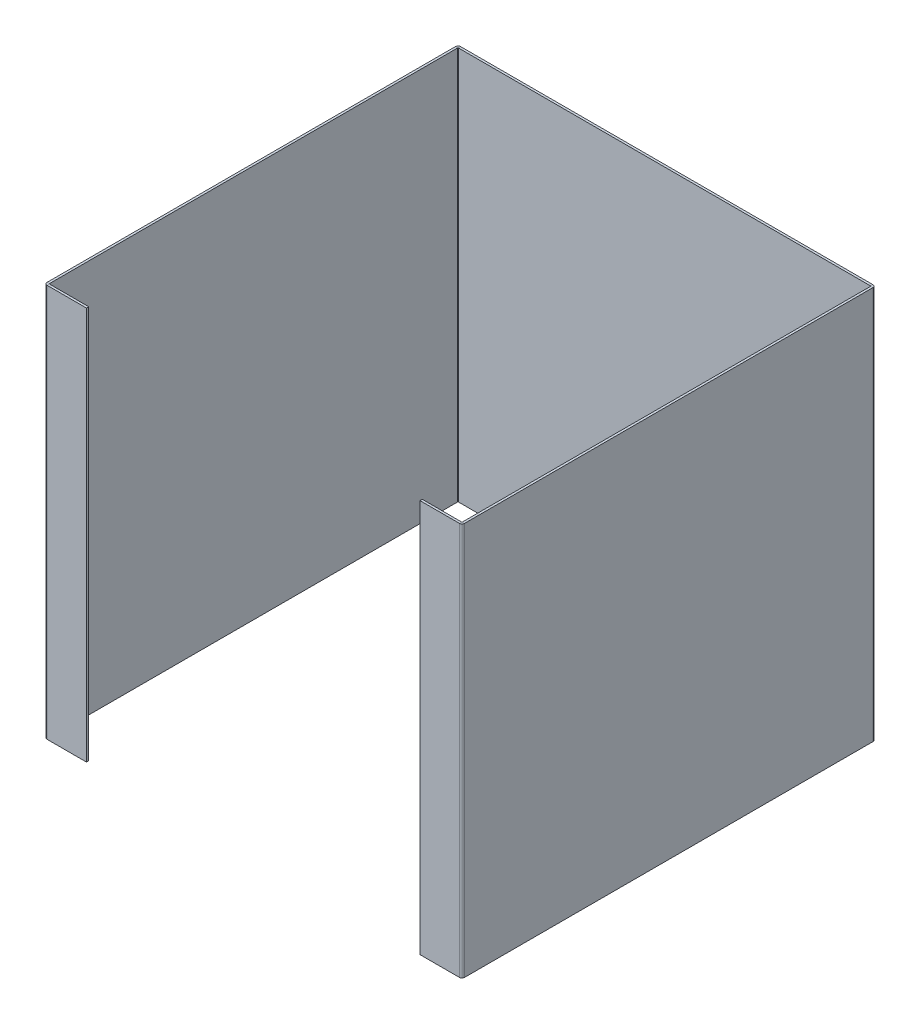
ISO-10303-21;
HEADER;
FILE_DESCRIPTION(('STEP AP214'),'2;1');
FILE_NAME('part.step','',(''),(''),'','','');
FILE_SCHEMA(('AUTOMOTIVE_DESIGN { 1 0 10303 214 1 1 1 1 }'));
ENDSEC;
DATA;
#1=APPLICATION_CONTEXT('core data for automotive mechanical design processes');
#2=APPLICATION_PROTOCOL_DEFINITION('international standard','automotive_design',2000,#1);
#3=PRODUCT_CONTEXT('',#1,'mechanical');
#4=PRODUCT('Part','Part','',(#3));
#5=PRODUCT_RELATED_PRODUCT_CATEGORY('part','',(#4));
#6=PRODUCT_DEFINITION_FORMATION('','',#4);
#7=PRODUCT_DEFINITION_CONTEXT('part definition',#1,'design');
#8=PRODUCT_DEFINITION('design','',#6,#7);
#9=PRODUCT_DEFINITION_SHAPE('','',#8);
#10=(LENGTH_UNIT() NAMED_UNIT(*) SI_UNIT(.MILLI.,.METRE.));
#11=(NAMED_UNIT(*) PLANE_ANGLE_UNIT() SI_UNIT($,.RADIAN.));
#12=(NAMED_UNIT(*) SI_UNIT($,.STERADIAN.) SOLID_ANGLE_UNIT());
#13=UNCERTAINTY_MEASURE_WITH_UNIT(LENGTH_MEASURE(1.E-05),#10,'distance_accuracy_value','');
#14=(GEOMETRIC_REPRESENTATION_CONTEXT(3) GLOBAL_UNCERTAINTY_ASSIGNED_CONTEXT((#13)) GLOBAL_UNIT_ASSIGNED_CONTEXT((#10,
#11,#12)) REPRESENTATION_CONTEXT('',''));
#15=CARTESIAN_POINT('',(0.,0.,0.));
#16=DIRECTION('',(0.,0.,1.));
#17=DIRECTION('',(1.,0.,0.));
#18=AXIS2_PLACEMENT_3D('',#15,#16,#17);
#19=CARTESIAN_POINT('',(-199.05892,0.,0.));
#20=DIRECTION('',(0.,-1.,0.));
#21=DIRECTION('',(0.,0.,1.));
#22=AXIS2_PLACEMENT_3D('',#19,#20,#21);
#23=PLANE('',#22);
#24=DIRECTION('',(-1.,0.,0.));
#25=VECTOR('',#24,1.);
#26=CARTESIAN_POINT('',(-199.05892,0.,194.619));
#27=LINE('',#26,#25);
#28=CARTESIAN_POINT('',(-196.89992,0.,194.619));
#29=VERTEX_POINT('',#28);
#30=CARTESIAN_POINT('',(-199.05892,0.,194.619));
#31=VERTEX_POINT('',#30);
#32=EDGE_CURVE('E12',#29,#31,#27,.T.);
#33=ORIENTED_EDGE('',*,*,#32,.F.);
#34=DIRECTION('',(0.,0.,1.));
#35=VECTOR('',#34,1.);
#36=CARTESIAN_POINT('',(-196.89992,0.,0.));
#37=LINE('',#36,#35);
#38=CARTESIAN_POINT('',(-196.89992,0.,-194.619));
#39=VERTEX_POINT('',#38);
#40=EDGE_CURVE('E157',#39,#29,#37,.T.);
#41=ORIENTED_EDGE('',*,*,#40,.F.);
#42=DIRECTION('',(-1.,0.,0.));
#43=VECTOR('',#42,1.);
#44=CARTESIAN_POINT('',(-199.05892,0.,-194.619));
#45=LINE('',#44,#43);
#46=CARTESIAN_POINT('',(-199.05892,0.,-194.619));
#47=VERTEX_POINT('',#46);
#48=EDGE_CURVE('E79',#39,#47,#45,.T.);
#49=ORIENTED_EDGE('',*,*,#48,.T.);
#50=DIRECTION('',(0.,0.,1.));
#51=VECTOR('',#50,1.);
#52=CARTESIAN_POINT('',(-199.05892,0.,0.));
#53=LINE('',#52,#51);
#54=EDGE_CURVE('E160',#47,#31,#53,.T.);
#55=ORIENTED_EDGE('',*,*,#54,.T.);
#56=EDGE_LOOP('',(#33,#41,#49,#55));
#57=FACE_BOUND('',#56,.T.);
#58=ADVANCED_FACE('F69',(#57),#23,.F.);
#59=CARTESIAN_POINT('',(-196.51892,0.,-194.619));
#60=DIRECTION('',(0.,-1.,0.));
#61=DIRECTION('',(0.,0.,-1.));
#62=AXIS2_PLACEMENT_3D('',#59,#60,#61);
#63=PLANE('',#62);
#64=ORIENTED_EDGE('',*,*,#48,.F.);
#65=CARTESIAN_POINT('',(-196.51892,0.,-194.619));
#66=DIRECTION('',(0.,1.,0.));
#67=DIRECTION('',(0.,0.,1.));
#68=AXIS2_PLACEMENT_3D('',#65,#66,#67);
#69=CIRCLE('',#68,0.381);
#70=CARTESIAN_POINT('',(-196.51892,0.,-195.));
#71=VERTEX_POINT('',#70);
#72=EDGE_CURVE('E199',#39,#71,#69,.F.);
#73=ORIENTED_EDGE('',*,*,#72,.T.);
#74=DIRECTION('',(0.,0.,-1.));
#75=VECTOR('',#74,1.);
#76=CARTESIAN_POINT('',(-196.51892,0.,-197.159));
#77=LINE('',#76,#75);
#78=CARTESIAN_POINT('',(-196.51892,0.,-197.159));
#79=VERTEX_POINT('',#78);
#80=EDGE_CURVE('E250',#71,#79,#77,.T.);
#81=ORIENTED_EDGE('',*,*,#80,.T.);
#82=CARTESIAN_POINT('',(-196.51892,0.,-194.619));
#83=DIRECTION('',(0.,1.,0.));
#84=DIRECTION('',(0.,0.,1.));
#85=AXIS2_PLACEMENT_3D('',#82,#83,#84);
#86=CIRCLE('',#85,2.54);
#87=EDGE_CURVE('E272',#47,#79,#86,.F.);
#88=ORIENTED_EDGE('',*,*,#87,.F.);
#89=EDGE_LOOP('',(#64,#73,#81,#88));
#90=FACE_BOUND('',#89,.T.);
#91=ADVANCED_FACE('F273',(#90),#63,.F.);
#92=CARTESIAN_POINT('',(0.,0.,-197.159));
#93=DIRECTION('',(0.,-1.,0.));
#94=DIRECTION('',(-1.,0.,0.));
#95=AXIS2_PLACEMENT_3D('',#92,#93,#94);
#96=PLANE('',#95);
#97=ORIENTED_EDGE('',*,*,#80,.F.);
#98=DIRECTION('',(-1.,0.,0.));
#99=VECTOR('',#98,1.);
#100=CARTESIAN_POINT('',(0.,0.,-195.));
#101=LINE('',#100,#99);
#102=CARTESIAN_POINT('',(196.51892,0.,-195.));
#103=VERTEX_POINT('',#102);
#104=EDGE_CURVE('E353',#103,#71,#101,.T.);
#105=ORIENTED_EDGE('',*,*,#104,.F.);
#106=DIRECTION('',(0.,0.,-1.));
#107=VECTOR('',#106,1.);
#108=CARTESIAN_POINT('',(196.51892,0.,-197.159));
#109=LINE('',#108,#107);
#110=CARTESIAN_POINT('',(196.51892,0.,-197.159));
#111=VERTEX_POINT('',#110);
#112=EDGE_CURVE('E247',#103,#111,#109,.T.);
#113=ORIENTED_EDGE('',*,*,#112,.T.);
#114=DIRECTION('',(-1.,0.,0.));
#115=VECTOR('',#114,1.);
#116=CARTESIAN_POINT('',(0.,0.,-197.159));
#117=LINE('',#116,#115);
#118=EDGE_CURVE('E395',#111,#79,#117,.T.);
#119=ORIENTED_EDGE('',*,*,#118,.T.);
#120=EDGE_LOOP('',(#97,#105,#113,#119));
#121=FACE_BOUND('',#120,.T.);
#122=ADVANCED_FACE('F392',(#121),#96,.F.);
#123=CARTESIAN_POINT('',(196.51892,0.,-194.619));
#124=DIRECTION('',(0.,-1.,0.));
#125=DIRECTION('',(0.,0.,-1.));
#126=AXIS2_PLACEMENT_3D('',#123,#124,#125);
#127=PLANE('',#126);
#128=ORIENTED_EDGE('',*,*,#112,.F.);
#129=CARTESIAN_POINT('',(196.51892,0.,-194.619));
#130=DIRECTION('',(0.,1.,0.));
#131=DIRECTION('',(0.,0.,1.));
#132=AXIS2_PLACEMENT_3D('',#129,#130,#131);
#133=CIRCLE('',#132,0.381);
#134=CARTESIAN_POINT('',(196.89992,0.,-194.619));
#135=VERTEX_POINT('',#134);
#136=EDGE_CURVE('E358',#103,#135,#133,.F.);
#137=ORIENTED_EDGE('',*,*,#136,.T.);
#138=DIRECTION('',(1.,0.,0.));
#139=VECTOR('',#138,1.);
#140=CARTESIAN_POINT('',(199.05892,0.,-194.619));
#141=LINE('',#140,#139);
#142=CARTESIAN_POINT('',(199.05892,0.,-194.619));
#143=VERTEX_POINT('',#142);
#144=EDGE_CURVE('E244',#135,#143,#141,.T.);
#145=ORIENTED_EDGE('',*,*,#144,.T.);
#146=CARTESIAN_POINT('',(196.51892,0.,-194.619));
#147=DIRECTION('',(0.,1.,0.));
#148=DIRECTION('',(0.,0.,1.));
#149=AXIS2_PLACEMENT_3D('',#146,#147,#148);
#150=CIRCLE('',#149,2.54);
#151=EDGE_CURVE('E303',#111,#143,#150,.F.);
#152=ORIENTED_EDGE('',*,*,#151,.F.);
#153=EDGE_LOOP('',(#128,#137,#145,#152));
#154=FACE_BOUND('',#153,.T.);
#155=ADVANCED_FACE('F518',(#154),#127,.F.);
#156=CARTESIAN_POINT('',(199.05892,0.,0.));
#157=DIRECTION('',(0.,-1.,0.));
#158=DIRECTION('',(0.,0.,-1.));
#159=AXIS2_PLACEMENT_3D('',#156,#157,#158);
#160=PLANE('',#159);
#161=ORIENTED_EDGE('',*,*,#144,.F.);
#162=DIRECTION('',(0.,0.,-1.));
#163=VECTOR('',#162,1.);
#164=CARTESIAN_POINT('',(196.89992,0.,0.));
#165=LINE('',#164,#163);
#166=CARTESIAN_POINT('',(196.89992,0.,194.619));
#167=VERTEX_POINT('',#166);
#168=EDGE_CURVE('E196',#167,#135,#165,.T.);
#169=ORIENTED_EDGE('',*,*,#168,.F.);
#170=DIRECTION('',(1.,0.,0.));
#171=VECTOR('',#170,1.);
#172=CARTESIAN_POINT('',(199.05892,0.,194.619));
#173=LINE('',#172,#171);
#174=CARTESIAN_POINT('',(199.05892,0.,194.619));
#175=VERTEX_POINT('',#174);
#176=EDGE_CURVE('E87',#167,#175,#173,.T.);
#177=ORIENTED_EDGE('',*,*,#176,.T.);
#178=DIRECTION('',(0.,0.,-1.));
#179=VECTOR('',#178,1.);
#180=CARTESIAN_POINT('',(199.05892,0.,0.));
#181=LINE('',#180,#179);
#182=EDGE_CURVE('E459',#175,#143,#181,.T.);
#183=ORIENTED_EDGE('',*,*,#182,.T.);
#184=EDGE_LOOP('',(#161,#169,#177,#183));
#185=FACE_BOUND('',#184,.T.);
#186=ADVANCED_FACE('F519',(#185),#160,.F.);
#187=CARTESIAN_POINT('',(196.51892,0.,194.619));
#188=DIRECTION('',(0.,-1.,0.));
#189=DIRECTION('',(0.,0.,-1.));
#190=AXIS2_PLACEMENT_3D('',#187,#188,#189);
#191=PLANE('',#190);
#192=ORIENTED_EDGE('',*,*,#176,.F.);
#193=CARTESIAN_POINT('',(196.51892,0.,194.619));
#194=DIRECTION('',(0.,1.,0.));
#195=DIRECTION('',(0.,0.,1.));
#196=AXIS2_PLACEMENT_3D('',#193,#194,#195);
#197=CIRCLE('',#196,0.381);
#198=CARTESIAN_POINT('',(196.51892,0.,195.));
#199=VERTEX_POINT('',#198);
#200=EDGE_CURVE('E366',#167,#199,#197,.F.);
#201=ORIENTED_EDGE('',*,*,#200,.T.);
#202=DIRECTION('',(0.,0.,1.));
#203=VECTOR('',#202,1.);
#204=CARTESIAN_POINT('',(196.51892,0.,197.159));
#205=LINE('',#204,#203);
#206=CARTESIAN_POINT('',(196.51892,0.,197.159));
#207=VERTEX_POINT('',#206);
#208=EDGE_CURVE('E240',#199,#207,#205,.T.);
#209=ORIENTED_EDGE('',*,*,#208,.T.);
#210=CARTESIAN_POINT('',(196.51892,0.,194.619));
#211=DIRECTION('',(0.,1.,0.));
#212=DIRECTION('',(0.,0.,1.));
#213=AXIS2_PLACEMENT_3D('',#210,#211,#212);
#214=CIRCLE('',#213,2.54);
#215=EDGE_CURVE('E315',#175,#207,#214,.F.);
#216=ORIENTED_EDGE('',*,*,#215,.F.);
#217=EDGE_LOOP('',(#192,#201,#209,#216));
#218=FACE_BOUND('',#217,.T.);
#219=ADVANCED_FACE('F423',(#218),#191,.F.);
#220=CARTESIAN_POINT('',(0.,0.,197.159));
#221=DIRECTION('',(0.,-1.,0.));
#222=DIRECTION('',(1.,0.,0.));
#223=AXIS2_PLACEMENT_3D('',#220,#221,#222);
#224=PLANE('',#223);
#225=ORIENTED_EDGE('',*,*,#208,.F.);
#226=DIRECTION('',(1.,0.,0.));
#227=VECTOR('',#226,1.);
#228=CARTESIAN_POINT('',(0.,0.,195.));
#229=LINE('',#228,#227);
#230=CARTESIAN_POINT('',(159.05892,0.,195.));
#231=VERTEX_POINT('',#230);
#232=EDGE_CURVE('E189',#231,#199,#229,.T.);
#233=ORIENTED_EDGE('',*,*,#232,.F.);
#234=DIRECTION('',(0.,0.,1.));
#235=VECTOR('',#234,1.);
#236=CARTESIAN_POINT('',(159.05892,0.,197.159));
#237=LINE('',#236,#235);
#238=CARTESIAN_POINT('',(159.05892,0.,197.159));
#239=VERTEX_POINT('',#238);
#240=EDGE_CURVE('E237',#231,#239,#237,.T.);
#241=ORIENTED_EDGE('',*,*,#240,.T.);
#242=DIRECTION('',(1.,0.,0.));
#243=VECTOR('',#242,1.);
#244=CARTESIAN_POINT('',(0.,0.,197.159));
#245=LINE('',#244,#243);
#246=EDGE_CURVE('E269',#239,#207,#245,.T.);
#247=ORIENTED_EDGE('',*,*,#246,.T.);
#248=EDGE_LOOP('',(#225,#233,#241,#247));
#249=FACE_BOUND('',#248,.T.);
#250=ADVANCED_FACE('F433',(#249),#224,.F.);
#251=CARTESIAN_POINT('',(159.05892,0.,197.159));
#252=DIRECTION('',(1.,0.,0.));
#253=DIRECTION('',(0.,1.,0.));
#254=AXIS2_PLACEMENT_3D('',#251,#252,#253);
#255=PLANE('',#254);
#256=ORIENTED_EDGE('',*,*,#240,.F.);
#257=DIRECTION('',(0.,1.,0.));
#258=VECTOR('',#257,1.);
#259=CARTESIAN_POINT('',(159.05892,-375.,195.));
#260=LINE('',#259,#258);
#261=CARTESIAN_POINT('',(159.05892,-375.,195.));
#262=VERTEX_POINT('',#261);
#263=EDGE_CURVE('E352',#262,#231,#260,.T.);
#264=ORIENTED_EDGE('',*,*,#263,.F.);
#265=DIRECTION('',(0.,0.,1.));
#266=VECTOR('',#265,1.);
#267=CARTESIAN_POINT('',(159.05892,-375.,197.159));
#268=LINE('',#267,#266);
#269=CARTESIAN_POINT('',(159.05892,-375.,197.159));
#270=VERTEX_POINT('',#269);
#271=EDGE_CURVE('E234',#262,#270,#268,.T.);
#272=ORIENTED_EDGE('',*,*,#271,.T.);
#273=DIRECTION('',(0.,1.,0.));
#274=VECTOR('',#273,1.);
#275=CARTESIAN_POINT('',(159.05892,0.,197.159));
#276=LINE('',#275,#274);
#277=EDGE_CURVE('E445',#270,#239,#276,.T.);
#278=ORIENTED_EDGE('',*,*,#277,.T.);
#279=EDGE_LOOP('',(#256,#264,#272,#278));
#280=FACE_BOUND('',#279,.T.);
#281=ADVANCED_FACE('F496',(#280),#255,.F.);
#282=CARTESIAN_POINT('',(0.,-375.,197.159));
#283=DIRECTION('',(0.,-1.,0.));
#284=DIRECTION('',(1.,0.,0.));
#285=AXIS2_PLACEMENT_3D('',#282,#283,#284);
#286=PLANE('',#285);
#287=ORIENTED_EDGE('',*,*,#271,.F.);
#288=DIRECTION('',(1.,0.,0.));
#289=VECTOR('',#288,1.);
#290=CARTESIAN_POINT('',(0.,-375.,195.));
#291=LINE('',#290,#289);
#292=CARTESIAN_POINT('',(196.51892,-375.,195.));
#293=VERTEX_POINT('',#292);
#294=EDGE_CURVE('E367',#262,#293,#291,.T.);
#295=ORIENTED_EDGE('',*,*,#294,.T.);
#296=DIRECTION('',(0.,0.,1.));
#297=VECTOR('',#296,1.);
#298=CARTESIAN_POINT('',(196.51892,-375.,197.159));
#299=LINE('',#298,#297);
#300=CARTESIAN_POINT('',(196.51892,-375.,197.159));
#301=VERTEX_POINT('',#300);
#302=EDGE_CURVE('E231',#293,#301,#299,.T.);
#303=ORIENTED_EDGE('',*,*,#302,.T.);
#304=DIRECTION('',(1.,0.,0.));
#305=VECTOR('',#304,1.);
#306=CARTESIAN_POINT('',(0.,-375.,197.159));
#307=LINE('',#306,#305);
#308=EDGE_CURVE('E438',#270,#301,#307,.T.);
#309=ORIENTED_EDGE('',*,*,#308,.F.);
#310=EDGE_LOOP('',(#287,#295,#303,#309));
#311=FACE_BOUND('',#310,.T.);
#312=ADVANCED_FACE('F498',(#311),#286,.T.);
#313=CARTESIAN_POINT('',(196.51892,-375.,194.619));
#314=DIRECTION('',(0.,1.,0.));
#315=DIRECTION('',(0.,0.,1.));
#316=AXIS2_PLACEMENT_3D('',#313,#314,#315);
#317=PLANE('',#316);
#318=ORIENTED_EDGE('',*,*,#302,.F.);
#319=CARTESIAN_POINT('',(196.51892,-375.,194.619));
#320=DIRECTION('',(0.,1.,0.));
#321=DIRECTION('',(0.,0.,1.));
#322=AXIS2_PLACEMENT_3D('',#319,#320,#321);
#323=CIRCLE('',#322,0.381);
#324=CARTESIAN_POINT('',(196.89992,-375.,194.619));
#325=VERTEX_POINT('',#324);
#326=EDGE_CURVE('E363',#293,#325,#323,.T.);
#327=ORIENTED_EDGE('',*,*,#326,.T.);
#328=DIRECTION('',(1.,0.,0.));
#329=VECTOR('',#328,1.);
#330=CARTESIAN_POINT('',(199.05892,-375.,194.619));
#331=LINE('',#330,#329);
#332=CARTESIAN_POINT('',(199.05892,-375.,194.619));
#333=VERTEX_POINT('',#332);
#334=EDGE_CURVE('E229',#325,#333,#331,.T.);
#335=ORIENTED_EDGE('',*,*,#334,.T.);
#336=CARTESIAN_POINT('',(196.51892,-375.,194.619));
#337=DIRECTION('',(0.,-1.,0.));
#338=DIRECTION('',(0.,0.,-1.));
#339=AXIS2_PLACEMENT_3D('',#336,#337,#338);
#340=CIRCLE('',#339,2.54);
#341=EDGE_CURVE('E306',#301,#333,#340,.F.);
#342=ORIENTED_EDGE('',*,*,#341,.F.);
#343=EDGE_LOOP('',(#318,#327,#335,#342));
#344=FACE_BOUND('',#343,.T.);
#345=ADVANCED_FACE('F450',(#344),#317,.F.);
#346=CARTESIAN_POINT('',(199.05892,-375.,0.));
#347=DIRECTION('',(0.,-1.,0.));
#348=DIRECTION('',(0.,0.,-1.));
#349=AXIS2_PLACEMENT_3D('',#346,#347,#348);
#350=PLANE('',#349);
#351=ORIENTED_EDGE('',*,*,#334,.F.);
#352=DIRECTION('',(0.,0.,-1.));
#353=VECTOR('',#352,1.);
#354=CARTESIAN_POINT('',(196.89992,-375.,0.));
#355=LINE('',#354,#353);
#356=CARTESIAN_POINT('',(196.89992,-375.,-194.619));
#357=VERTEX_POINT('',#356);
#358=EDGE_CURVE('E359',#325,#357,#355,.T.);
#359=ORIENTED_EDGE('',*,*,#358,.T.);
#360=DIRECTION('',(1.,0.,0.));
#361=VECTOR('',#360,1.);
#362=CARTESIAN_POINT('',(199.05892,-375.,-194.619));
#363=LINE('',#362,#361);
#364=CARTESIAN_POINT('',(199.05892,-375.,-194.619));
#365=VERTEX_POINT('',#364);
#366=EDGE_CURVE('E225',#357,#365,#363,.T.);
#367=ORIENTED_EDGE('',*,*,#366,.T.);
#368=DIRECTION('',(0.,0.,-1.));
#369=VECTOR('',#368,1.);
#370=CARTESIAN_POINT('',(199.05892,-375.,0.));
#371=LINE('',#370,#369);
#372=EDGE_CURVE('E402',#333,#365,#371,.T.);
#373=ORIENTED_EDGE('',*,*,#372,.F.);
#374=EDGE_LOOP('',(#351,#359,#367,#373));
#375=FACE_BOUND('',#374,.T.);
#376=ADVANCED_FACE('F455',(#375),#350,.T.);
#377=CARTESIAN_POINT('',(196.51892,-375.,-194.619));
#378=DIRECTION('',(0.,1.,0.));
#379=DIRECTION('',(0.,0.,1.));
#380=AXIS2_PLACEMENT_3D('',#377,#378,#379);
#381=PLANE('',#380);
#382=ORIENTED_EDGE('',*,*,#366,.F.);
#383=CARTESIAN_POINT('',(196.51892,-375.,-194.619));
#384=DIRECTION('',(0.,1.,0.));
#385=DIRECTION('',(0.,0.,1.));
#386=AXIS2_PLACEMENT_3D('',#383,#384,#385);
#387=CIRCLE('',#386,0.381);
#388=CARTESIAN_POINT('',(196.51892,-375.,-195.));
#389=VERTEX_POINT('',#388);
#390=EDGE_CURVE('E354',#357,#389,#387,.T.);
#391=ORIENTED_EDGE('',*,*,#390,.T.);
#392=DIRECTION('',(0.,0.,-1.));
#393=VECTOR('',#392,1.);
#394=CARTESIAN_POINT('',(196.51892,-375.,-197.159));
#395=LINE('',#394,#393);
#396=CARTESIAN_POINT('',(196.51892,-375.,-197.159));
#397=VERTEX_POINT('',#396);
#398=EDGE_CURVE('E221',#389,#397,#395,.T.);
#399=ORIENTED_EDGE('',*,*,#398,.T.);
#400=CARTESIAN_POINT('',(196.51892,-375.,-194.619));
#401=DIRECTION('',(0.,-1.,0.));
#402=DIRECTION('',(0.,0.,-1.));
#403=AXIS2_PLACEMENT_3D('',#400,#401,#402);
#404=CIRCLE('',#403,2.54);
#405=EDGE_CURVE('E279',#365,#397,#404,.F.);
#406=ORIENTED_EDGE('',*,*,#405,.F.);
#407=EDGE_LOOP('',(#382,#391,#399,#406));
#408=FACE_BOUND('',#407,.T.);
#409=ADVANCED_FACE('F513',(#408),#381,.F.);
#410=CARTESIAN_POINT('',(0.,-375.,-197.159));
#411=DIRECTION('',(0.,-1.,0.));
#412=DIRECTION('',(-1.,0.,0.));
#413=AXIS2_PLACEMENT_3D('',#410,#411,#412);
#414=PLANE('',#413);
#415=ORIENTED_EDGE('',*,*,#398,.F.);
#416=DIRECTION('',(-1.,0.,0.));
#417=VECTOR('',#416,1.);
#418=CARTESIAN_POINT('',(0.,-375.,-195.));
#419=LINE('',#418,#417);
#420=CARTESIAN_POINT('',(-196.51892,-375.,-195.));
#421=VERTEX_POINT('',#420);
#422=EDGE_CURVE('E348',#389,#421,#419,.T.);
#423=ORIENTED_EDGE('',*,*,#422,.T.);
#424=DIRECTION('',(0.,0.,-1.));
#425=VECTOR('',#424,1.);
#426=CARTESIAN_POINT('',(-196.51892,-375.,-197.159));
#427=LINE('',#426,#425);
#428=CARTESIAN_POINT('',(-196.51892,-375.,-197.159));
#429=VERTEX_POINT('',#428);
#430=EDGE_CURVE('E218',#421,#429,#427,.T.);
#431=ORIENTED_EDGE('',*,*,#430,.T.);
#432=DIRECTION('',(-1.,0.,0.));
#433=VECTOR('',#432,1.);
#434=CARTESIAN_POINT('',(0.,-375.,-197.159));
#435=LINE('',#434,#433);
#436=EDGE_CURVE('E401',#397,#429,#435,.T.);
#437=ORIENTED_EDGE('',*,*,#436,.F.);
#438=EDGE_LOOP('',(#415,#423,#431,#437));
#439=FACE_BOUND('',#438,.T.);
#440=ADVANCED_FACE('F612',(#439),#414,.T.);
#441=CARTESIAN_POINT('',(-196.51892,-375.,-194.619));
#442=DIRECTION('',(0.,1.,0.));
#443=DIRECTION('',(0.,0.,1.));
#444=AXIS2_PLACEMENT_3D('',#441,#442,#443);
#445=PLANE('',#444);
#446=ORIENTED_EDGE('',*,*,#430,.F.);
#447=CARTESIAN_POINT('',(-196.51892,-375.,-194.619));
#448=DIRECTION('',(0.,1.,0.));
#449=DIRECTION('',(0.,0.,1.));
#450=AXIS2_PLACEMENT_3D('',#447,#448,#449);
#451=CIRCLE('',#450,0.381);
#452=CARTESIAN_POINT('',(-196.89992,-375.,-194.619));
#453=VERTEX_POINT('',#452);
#454=EDGE_CURVE('E194',#421,#453,#451,.T.);
#455=ORIENTED_EDGE('',*,*,#454,.T.);
#456=DIRECTION('',(-1.,0.,0.));
#457=VECTOR('',#456,1.);
#458=CARTESIAN_POINT('',(-199.05892,-375.,-194.619));
#459=LINE('',#458,#457);
#460=CARTESIAN_POINT('',(-199.05892,-375.,-194.619));
#461=VERTEX_POINT('',#460);
#462=EDGE_CURVE('E215',#453,#461,#459,.T.);
#463=ORIENTED_EDGE('',*,*,#462,.T.);
#464=CARTESIAN_POINT('',(-196.51892,-375.,-194.619));
#465=DIRECTION('',(0.,-1.,0.));
#466=DIRECTION('',(0.,0.,-1.));
#467=AXIS2_PLACEMENT_3D('',#464,#465,#466);
#468=CIRCLE('',#467,2.54);
#469=EDGE_CURVE('E278',#429,#461,#468,.F.);
#470=ORIENTED_EDGE('',*,*,#469,.F.);
#471=EDGE_LOOP('',(#446,#455,#463,#470));
#472=FACE_BOUND('',#471,.T.);
#473=ADVANCED_FACE('F622',(#472),#445,.F.);
#474=CARTESIAN_POINT('',(-199.05892,-375.,0.));
#475=DIRECTION('',(0.,-1.,0.));
#476=DIRECTION('',(0.,0.,1.));
#477=AXIS2_PLACEMENT_3D('',#474,#475,#476);
#478=PLANE('',#477);
#479=ORIENTED_EDGE('',*,*,#462,.F.);
#480=DIRECTION('',(0.,0.,1.));
#481=VECTOR('',#480,1.);
#482=CARTESIAN_POINT('',(-196.89992,-375.,0.));
#483=LINE('',#482,#481);
#484=CARTESIAN_POINT('',(-196.89992,-375.,194.619));
#485=VERTEX_POINT('',#484);
#486=EDGE_CURVE('E188',#453,#485,#483,.T.);
#487=ORIENTED_EDGE('',*,*,#486,.T.);
#488=DIRECTION('',(-1.,0.,0.));
#489=VECTOR('',#488,1.);
#490=CARTESIAN_POINT('',(-199.05892,-375.,194.619));
#491=LINE('',#490,#489);
#492=CARTESIAN_POINT('',(-199.05892,-375.,194.619));
#493=VERTEX_POINT('',#492);
#494=EDGE_CURVE('E212',#485,#493,#491,.T.);
#495=ORIENTED_EDGE('',*,*,#494,.T.);
#496=DIRECTION('',(0.,0.,1.));
#497=VECTOR('',#496,1.);
#498=CARTESIAN_POINT('',(-199.05892,-375.,0.));
#499=LINE('',#498,#497);
#500=EDGE_CURVE('E268',#461,#493,#499,.T.);
#501=ORIENTED_EDGE('',*,*,#500,.F.);
#502=EDGE_LOOP('',(#479,#487,#495,#501));
#503=FACE_BOUND('',#502,.T.);
#504=ADVANCED_FACE('F632',(#503),#478,.T.);
#505=CARTESIAN_POINT('',(-196.51892,-375.,194.619));
#506=DIRECTION('',(0.,1.,0.));
#507=DIRECTION('',(0.,0.,1.));
#508=AXIS2_PLACEMENT_3D('',#505,#506,#507);
#509=PLANE('',#508);
#510=ORIENTED_EDGE('',*,*,#494,.F.);
#511=CARTESIAN_POINT('',(-196.51892,-375.,194.619));
#512=DIRECTION('',(0.,1.,0.));
#513=DIRECTION('',(0.,0.,1.));
#514=AXIS2_PLACEMENT_3D('',#511,#512,#513);
#515=CIRCLE('',#514,0.381);
#516=CARTESIAN_POINT('',(-196.51892,-375.,195.));
#517=VERTEX_POINT('',#516);
#518=EDGE_CURVE('E176',#485,#517,#515,.T.);
#519=ORIENTED_EDGE('',*,*,#518,.T.);
#520=DIRECTION('',(0.,0.,1.));
#521=VECTOR('',#520,1.);
#522=CARTESIAN_POINT('',(-196.51892,-375.,197.159));
#523=LINE('',#522,#521);
#524=CARTESIAN_POINT('',(-196.51892,-375.,197.159));
#525=VERTEX_POINT('',#524);
#526=EDGE_CURVE('E209',#517,#525,#523,.T.);
#527=ORIENTED_EDGE('',*,*,#526,.T.);
#528=CARTESIAN_POINT('',(-196.51892,-375.,194.619));
#529=DIRECTION('',(0.,-1.,0.));
#530=DIRECTION('',(0.,0.,-1.));
#531=AXIS2_PLACEMENT_3D('',#528,#529,#530);
#532=CIRCLE('',#531,2.54);
#533=EDGE_CURVE('E463',#493,#525,#532,.F.);
#534=ORIENTED_EDGE('',*,*,#533,.F.);
#535=EDGE_LOOP('',(#510,#519,#527,#534));
#536=FACE_BOUND('',#535,.T.);
#537=ADVANCED_FACE('F643',(#536),#509,.F.);
#538=ORIENTED_EDGE('',*,*,#526,.F.);
#539=DIRECTION('',(1.,0.,0.));
#540=VECTOR('',#539,1.);
#541=CARTESIAN_POINT('',(0.,-375.,195.));
#542=LINE('',#541,#540);
#543=CARTESIAN_POINT('',(-159.05892,-375.,195.));
#544=VERTEX_POINT('',#543);
#545=EDGE_CURVE('E181',#517,#544,#542,.T.);
#546=ORIENTED_EDGE('',*,*,#545,.T.);
#547=DIRECTION('',(0.,0.,1.));
#548=VECTOR('',#547,1.);
#549=CARTESIAN_POINT('',(-159.05892,-375.,197.159));
#550=LINE('',#549,#548);
#551=CARTESIAN_POINT('',(-159.05892,-375.,197.159));
#552=VERTEX_POINT('',#551);
#553=EDGE_CURVE('E206',#544,#552,#550,.T.);
#554=ORIENTED_EDGE('',*,*,#553,.T.);
#555=EDGE_CURVE('E448',#525,#552,#307,.T.);
#556=ORIENTED_EDGE('',*,*,#555,.F.);
#557=EDGE_LOOP('',(#538,#546,#554,#556));
#558=FACE_BOUND('',#557,.T.);
#559=ADVANCED_FACE('F585',(#558),#286,.T.);
#560=CARTESIAN_POINT('',(-159.05892,0.,197.159));
#561=DIRECTION('',(-1.,0.,0.));
#562=DIRECTION('',(0.,-1.,0.));
#563=AXIS2_PLACEMENT_3D('',#560,#561,#562);
#564=PLANE('',#563);
#565=ORIENTED_EDGE('',*,*,#553,.F.);
#566=DIRECTION('',(0.,1.,0.));
#567=VECTOR('',#566,1.);
#568=CARTESIAN_POINT('',(-159.05892,-375.,195.));
#569=LINE('',#568,#567);
#570=CARTESIAN_POINT('',(-159.05892,0.,195.));
#571=VERTEX_POINT('',#570);
#572=EDGE_CURVE('E342',#571,#544,#569,.F.);
#573=ORIENTED_EDGE('',*,*,#572,.F.);
#574=DIRECTION('',(0.,0.,1.));
#575=VECTOR('',#574,1.);
#576=CARTESIAN_POINT('',(-159.05892,0.,197.159));
#577=LINE('',#576,#575);
#578=CARTESIAN_POINT('',(-159.05892,0.,197.159));
#579=VERTEX_POINT('',#578);
#580=EDGE_CURVE('E203',#571,#579,#577,.T.);
#581=ORIENTED_EDGE('',*,*,#580,.T.);
#582=DIRECTION('',(0.,-1.,0.));
#583=VECTOR('',#582,1.);
#584=CARTESIAN_POINT('',(-159.05892,0.,197.159));
#585=LINE('',#584,#583);
#586=EDGE_CURVE('E471',#579,#552,#585,.T.);
#587=ORIENTED_EDGE('',*,*,#586,.T.);
#588=EDGE_LOOP('',(#565,#573,#581,#587));
#589=FACE_BOUND('',#588,.T.);
#590=ADVANCED_FACE('F664',(#589),#564,.F.);
#591=ORIENTED_EDGE('',*,*,#580,.F.);
#592=DIRECTION('',(1.,0.,0.));
#593=VECTOR('',#592,1.);
#594=CARTESIAN_POINT('',(0.,0.,195.));
#595=LINE('',#594,#593);
#596=CARTESIAN_POINT('',(-196.51892,0.,195.));
#597=VERTEX_POINT('',#596);
#598=EDGE_CURVE('E339',#597,#571,#595,.T.);
#599=ORIENTED_EDGE('',*,*,#598,.F.);
#600=DIRECTION('',(0.,0.,1.));
#601=VECTOR('',#600,1.);
#602=CARTESIAN_POINT('',(-196.51892,0.,197.159));
#603=LINE('',#602,#601);
#604=CARTESIAN_POINT('',(-196.51892,0.,197.159));
#605=VERTEX_POINT('',#604);
#606=EDGE_CURVE('E73',#597,#605,#603,.T.);
#607=ORIENTED_EDGE('',*,*,#606,.T.);
#608=EDGE_CURVE('E440',#605,#579,#245,.T.);
#609=ORIENTED_EDGE('',*,*,#608,.T.);
#610=EDGE_LOOP('',(#591,#599,#607,#609));
#611=FACE_BOUND('',#610,.T.);
#612=ADVANCED_FACE('F566',(#611),#224,.F.);
#613=CARTESIAN_POINT('',(-196.51892,0.,194.619));
#614=DIRECTION('',(0.,-1.,0.));
#615=DIRECTION('',(0.,0.,-1.));
#616=AXIS2_PLACEMENT_3D('',#613,#614,#615);
#617=PLANE('',#616);
#618=CARTESIAN_POINT('',(-196.51892,0.,194.619));
#619=DIRECTION('',(0.,1.,0.));
#620=DIRECTION('',(0.,0.,1.));
#621=AXIS2_PLACEMENT_3D('',#618,#619,#620);
#622=CIRCLE('',#621,0.381);
#623=EDGE_CURVE('E173',#597,#29,#622,.F.);
#624=ORIENTED_EDGE('',*,*,#623,.T.);
#625=ORIENTED_EDGE('',*,*,#32,.T.);
#626=CARTESIAN_POINT('',(-196.51892,0.,194.619));
#627=DIRECTION('',(0.,1.,0.));
#628=DIRECTION('',(0.,0.,1.));
#629=AXIS2_PLACEMENT_3D('',#626,#627,#628);
#630=CIRCLE('',#629,2.54);
#631=EDGE_CURVE('E297',#605,#31,#630,.F.);
#632=ORIENTED_EDGE('',*,*,#631,.F.);
#633=ORIENTED_EDGE('',*,*,#606,.F.);
#634=EDGE_LOOP('',(#624,#625,#632,#633));
#635=FACE_BOUND('',#634,.T.);
#636=ADVANCED_FACE('F71',(#635),#617,.F.);
#637=CARTESIAN_POINT('',(0.,-375.,197.159));
#638=DIRECTION('',(0.,0.,1.));
#639=DIRECTION('',(1.,0.,0.));
#640=AXIS2_PLACEMENT_3D('',#637,#638,#639);
#641=PLANE('',#640);
#642=ORIENTED_EDGE('',*,*,#608,.F.);
#643=DIRECTION('',(0.,1.,0.));
#644=VECTOR('',#643,1.);
#645=CARTESIAN_POINT('',(-196.51892,-375.,197.159));
#646=LINE('',#645,#644);
#647=EDGE_CURVE('E293',#605,#525,#646,.F.);
#648=ORIENTED_EDGE('',*,*,#647,.T.);
#649=ORIENTED_EDGE('',*,*,#555,.T.);
#650=ORIENTED_EDGE('',*,*,#586,.F.);
#651=EDGE_LOOP('',(#642,#648,#649,#650));
#652=FACE_BOUND('',#651,.T.);
#653=ADVANCED_FACE('F692',(#652),#641,.T.);
#654=CARTESIAN_POINT('',(-199.05892,-375.,0.));
#655=DIRECTION('',(-1.,0.,0.));
#656=DIRECTION('',(0.,0.,1.));
#657=AXIS2_PLACEMENT_3D('',#654,#655,#656);
#658=PLANE('',#657);
#659=ORIENTED_EDGE('',*,*,#54,.F.);
#660=DIRECTION('',(0.,1.,0.));
#661=VECTOR('',#660,1.);
#662=CARTESIAN_POINT('',(-199.05892,-375.,-194.619));
#663=LINE('',#662,#661);
#664=EDGE_CURVE('E265',#47,#461,#663,.F.);
#665=ORIENTED_EDGE('',*,*,#664,.T.);
#666=ORIENTED_EDGE('',*,*,#500,.T.);
#667=DIRECTION('',(0.,1.,0.));
#668=VECTOR('',#667,1.);
#669=CARTESIAN_POINT('',(-199.05892,-375.,194.619));
#670=LINE('',#669,#668);
#671=EDGE_CURVE('E267',#493,#31,#670,.T.);
#672=ORIENTED_EDGE('',*,*,#671,.T.);
#673=EDGE_LOOP('',(#659,#665,#666,#672));
#674=FACE_BOUND('',#673,.T.);
#675=ADVANCED_FACE('F262',(#674),#658,.T.);
#676=ORIENTED_EDGE('',*,*,#308,.T.);
#677=DIRECTION('',(0.,1.,0.));
#678=VECTOR('',#677,1.);
#679=CARTESIAN_POINT('',(196.51892,-375.,197.159));
#680=LINE('',#679,#678);
#681=EDGE_CURVE('E302',#301,#207,#680,.T.);
#682=ORIENTED_EDGE('',*,*,#681,.T.);
#683=ORIENTED_EDGE('',*,*,#246,.F.);
#684=ORIENTED_EDGE('',*,*,#277,.F.);
#685=EDGE_LOOP('',(#676,#682,#683,#684));
#686=FACE_BOUND('',#685,.T.);
#687=ADVANCED_FACE('F442',(#686),#641,.T.);
#688=CARTESIAN_POINT('',(0.,-375.,-197.159));
#689=DIRECTION('',(0.,0.,-1.));
#690=DIRECTION('',(-1.,0.,0.));
#691=AXIS2_PLACEMENT_3D('',#688,#689,#690);
#692=PLANE('',#691);
#693=ORIENTED_EDGE('',*,*,#118,.F.);
#694=DIRECTION('',(0.,1.,0.));
#695=VECTOR('',#694,1.);
#696=CARTESIAN_POINT('',(196.51892,-375.,-197.159));
#697=LINE('',#696,#695);
#698=EDGE_CURVE('E290',#111,#397,#697,.F.);
#699=ORIENTED_EDGE('',*,*,#698,.T.);
#700=ORIENTED_EDGE('',*,*,#436,.T.);
#701=DIRECTION('',(0.,1.,0.));
#702=VECTOR('',#701,1.);
#703=CARTESIAN_POINT('',(-196.51892,-375.,-197.159));
#704=LINE('',#703,#702);
#705=EDGE_CURVE('E286',#429,#79,#704,.T.);
#706=ORIENTED_EDGE('',*,*,#705,.T.);
#707=EDGE_LOOP('',(#693,#699,#700,#706));
#708=FACE_BOUND('',#707,.T.);
#709=ADVANCED_FACE('F405',(#708),#692,.T.);
#710=CARTESIAN_POINT('',(199.05892,-375.,0.));
#711=DIRECTION('',(1.,0.,0.));
#712=DIRECTION('',(0.,0.,-1.));
#713=AXIS2_PLACEMENT_3D('',#710,#711,#712);
#714=PLANE('',#713);
#715=ORIENTED_EDGE('',*,*,#182,.F.);
#716=DIRECTION('',(0.,1.,0.));
#717=VECTOR('',#716,1.);
#718=CARTESIAN_POINT('',(199.05892,-375.,194.619));
#719=LINE('',#718,#717);
#720=EDGE_CURVE('E312',#175,#333,#719,.F.);
#721=ORIENTED_EDGE('',*,*,#720,.T.);
#722=ORIENTED_EDGE('',*,*,#372,.T.);
#723=DIRECTION('',(0.,1.,0.));
#724=VECTOR('',#723,1.);
#725=CARTESIAN_POINT('',(199.05892,-375.,-194.619));
#726=LINE('',#725,#724);
#727=EDGE_CURVE('E285',#365,#143,#726,.T.);
#728=ORIENTED_EDGE('',*,*,#727,.T.);
#729=EDGE_LOOP('',(#715,#721,#722,#728));
#730=FACE_BOUND('',#729,.T.);
#731=ADVANCED_FACE('F461',(#730),#714,.T.);
#732=CARTESIAN_POINT('',(-196.51892,-375.,194.619));
#733=DIRECTION('',(0.,1.,0.));
#734=DIRECTION('',(0.,0.,1.));
#735=AXIS2_PLACEMENT_3D('',#732,#733,#734);
#736=CYLINDRICAL_SURFACE('',#735,2.54);
#737=ORIENTED_EDGE('',*,*,#533,.T.);
#738=ORIENTED_EDGE('',*,*,#647,.F.);
#739=ORIENTED_EDGE('',*,*,#631,.T.);
#740=ORIENTED_EDGE('',*,*,#671,.F.);
#741=EDGE_LOOP('',(#737,#738,#739,#740));
#742=FACE_BOUND('',#741,.T.);
#743=ADVANCED_FACE('F479',(#742),#736,.T.);
#744=CARTESIAN_POINT('',(-196.51892,-375.,-194.619));
#745=DIRECTION('',(0.,1.,0.));
#746=DIRECTION('',(0.,0.,1.));
#747=AXIS2_PLACEMENT_3D('',#744,#745,#746);
#748=CYLINDRICAL_SURFACE('',#747,2.54);
#749=ORIENTED_EDGE('',*,*,#469,.T.);
#750=ORIENTED_EDGE('',*,*,#664,.F.);
#751=ORIENTED_EDGE('',*,*,#87,.T.);
#752=ORIENTED_EDGE('',*,*,#705,.F.);
#753=EDGE_LOOP('',(#749,#750,#751,#752));
#754=FACE_BOUND('',#753,.T.);
#755=ADVANCED_FACE('F282',(#754),#748,.T.);
#756=CARTESIAN_POINT('',(196.51892,-375.,-194.619));
#757=DIRECTION('',(0.,1.,0.));
#758=DIRECTION('',(0.,0.,1.));
#759=AXIS2_PLACEMENT_3D('',#756,#757,#758);
#760=CYLINDRICAL_SURFACE('',#759,2.54);
#761=ORIENTED_EDGE('',*,*,#405,.T.);
#762=ORIENTED_EDGE('',*,*,#698,.F.);
#763=ORIENTED_EDGE('',*,*,#151,.T.);
#764=ORIENTED_EDGE('',*,*,#727,.F.);
#765=EDGE_LOOP('',(#761,#762,#763,#764));
#766=FACE_BOUND('',#765,.T.);
#767=ADVANCED_FACE('F516',(#766),#760,.T.);
#768=CARTESIAN_POINT('',(196.51892,-375.,194.619));
#769=DIRECTION('',(0.,1.,0.));
#770=DIRECTION('',(0.,0.,1.));
#771=AXIS2_PLACEMENT_3D('',#768,#769,#770);
#772=CYLINDRICAL_SURFACE('',#771,2.54);
#773=ORIENTED_EDGE('',*,*,#341,.T.);
#774=ORIENTED_EDGE('',*,*,#720,.F.);
#775=ORIENTED_EDGE('',*,*,#215,.T.);
#776=ORIENTED_EDGE('',*,*,#681,.F.);
#777=EDGE_LOOP('',(#773,#774,#775,#776));
#778=FACE_BOUND('',#777,.T.);
#779=ADVANCED_FACE('F431',(#778),#772,.T.);
#780=CARTESIAN_POINT('',(0.,-375.,195.));
#781=DIRECTION('',(0.,0.,1.));
#782=DIRECTION('',(1.,0.,0.));
#783=AXIS2_PLACEMENT_3D('',#780,#781,#782);
#784=PLANE('',#783);
#785=ORIENTED_EDGE('',*,*,#598,.T.);
#786=ORIENTED_EDGE('',*,*,#572,.T.);
#787=ORIENTED_EDGE('',*,*,#545,.F.);
#788=DIRECTION('',(0.,1.,0.));
#789=VECTOR('',#788,1.);
#790=CARTESIAN_POINT('',(-196.51892,-375.,195.));
#791=LINE('',#790,#789);
#792=EDGE_CURVE('E180',#597,#517,#791,.F.);
#793=ORIENTED_EDGE('',*,*,#792,.F.);
#794=EDGE_LOOP('',(#785,#786,#787,#793));
#795=FACE_BOUND('',#794,.T.);
#796=ADVANCED_FACE('F774',(#795),#784,.F.);
#797=CARTESIAN_POINT('',(-196.89992,-375.,0.));
#798=DIRECTION('',(-1.,0.,0.));
#799=DIRECTION('',(0.,0.,1.));
#800=AXIS2_PLACEMENT_3D('',#797,#798,#799);
#801=PLANE('',#800);
#802=ORIENTED_EDGE('',*,*,#40,.T.);
#803=DIRECTION('',(0.,1.,0.));
#804=VECTOR('',#803,1.);
#805=CARTESIAN_POINT('',(-196.89992,-375.,194.619));
#806=LINE('',#805,#804);
#807=EDGE_CURVE('E170',#485,#29,#806,.T.);
#808=ORIENTED_EDGE('',*,*,#807,.F.);
#809=ORIENTED_EDGE('',*,*,#486,.F.);
#810=DIRECTION('',(0.,1.,0.));
#811=VECTOR('',#810,1.);
#812=CARTESIAN_POINT('',(-196.89992,-375.,-194.619));
#813=LINE('',#812,#811);
#814=EDGE_CURVE('E186',#39,#453,#813,.F.);
#815=ORIENTED_EDGE('',*,*,#814,.F.);
#816=EDGE_LOOP('',(#802,#808,#809,#815));
#817=FACE_BOUND('',#816,.T.);
#818=ADVANCED_FACE('F184',(#817),#801,.F.);
#819=ORIENTED_EDGE('',*,*,#294,.F.);
#820=ORIENTED_EDGE('',*,*,#263,.T.);
#821=ORIENTED_EDGE('',*,*,#232,.T.);
#822=DIRECTION('',(0.,1.,0.));
#823=VECTOR('',#822,1.);
#824=CARTESIAN_POINT('',(196.51892,-375.,195.));
#825=LINE('',#824,#823);
#826=EDGE_CURVE('E331',#293,#199,#825,.T.);
#827=ORIENTED_EDGE('',*,*,#826,.F.);
#828=EDGE_LOOP('',(#819,#820,#821,#827));
#829=FACE_BOUND('',#828,.T.);
#830=ADVANCED_FACE('F500',(#829),#784,.F.);
#831=CARTESIAN_POINT('',(0.,-375.,-195.));
#832=DIRECTION('',(0.,0.,-1.));
#833=DIRECTION('',(-1.,0.,0.));
#834=AXIS2_PLACEMENT_3D('',#831,#832,#833);
#835=PLANE('',#834);
#836=ORIENTED_EDGE('',*,*,#104,.T.);
#837=DIRECTION('',(0.,1.,0.));
#838=VECTOR('',#837,1.);
#839=CARTESIAN_POINT('',(-196.51892,-375.,-195.));
#840=LINE('',#839,#838);
#841=EDGE_CURVE('E321',#421,#71,#840,.T.);
#842=ORIENTED_EDGE('',*,*,#841,.F.);
#843=ORIENTED_EDGE('',*,*,#422,.F.);
#844=DIRECTION('',(0.,1.,0.));
#845=VECTOR('',#844,1.);
#846=CARTESIAN_POINT('',(196.51892,-375.,-195.));
#847=LINE('',#846,#845);
#848=EDGE_CURVE('E327',#103,#389,#847,.F.);
#849=ORIENTED_EDGE('',*,*,#848,.F.);
#850=EDGE_LOOP('',(#836,#842,#843,#849));
#851=FACE_BOUND('',#850,.T.);
#852=ADVANCED_FACE('F389',(#851),#835,.F.);
#853=CARTESIAN_POINT('',(196.89992,-375.,0.));
#854=DIRECTION('',(1.,0.,0.));
#855=DIRECTION('',(0.,0.,-1.));
#856=AXIS2_PLACEMENT_3D('',#853,#854,#855);
#857=PLANE('',#856);
#858=ORIENTED_EDGE('',*,*,#168,.T.);
#859=DIRECTION('',(0.,1.,0.));
#860=VECTOR('',#859,1.);
#861=CARTESIAN_POINT('',(196.89992,-375.,-194.619));
#862=LINE('',#861,#860);
#863=EDGE_CURVE('E324',#357,#135,#862,.T.);
#864=ORIENTED_EDGE('',*,*,#863,.F.);
#865=ORIENTED_EDGE('',*,*,#358,.F.);
#866=DIRECTION('',(0.,1.,0.));
#867=VECTOR('',#866,1.);
#868=CARTESIAN_POINT('',(196.89992,-375.,194.619));
#869=LINE('',#868,#867);
#870=EDGE_CURVE('E318',#167,#325,#869,.F.);
#871=ORIENTED_EDGE('',*,*,#870,.F.);
#872=EDGE_LOOP('',(#858,#864,#865,#871));
#873=FACE_BOUND('',#872,.T.);
#874=ADVANCED_FACE('F508',(#873),#857,.F.);
#875=CARTESIAN_POINT('',(-196.51892,-375.,194.619));
#876=DIRECTION('',(0.,1.,0.));
#877=DIRECTION('',(0.,0.,1.));
#878=AXIS2_PLACEMENT_3D('',#875,#876,#877);
#879=CYLINDRICAL_SURFACE('',#878,0.381);
#880=ORIENTED_EDGE('',*,*,#518,.F.);
#881=ORIENTED_EDGE('',*,*,#807,.T.);
#882=ORIENTED_EDGE('',*,*,#623,.F.);
#883=ORIENTED_EDGE('',*,*,#792,.T.);
#884=EDGE_LOOP('',(#880,#881,#882,#883));
#885=FACE_BOUND('',#884,.T.);
#886=ADVANCED_FACE('F171',(#885),#879,.F.);
#887=CARTESIAN_POINT('',(-196.51892,-375.,-194.619));
#888=DIRECTION('',(0.,1.,0.));
#889=DIRECTION('',(0.,0.,1.));
#890=AXIS2_PLACEMENT_3D('',#887,#888,#889);
#891=CYLINDRICAL_SURFACE('',#890,0.381);
#892=ORIENTED_EDGE('',*,*,#454,.F.);
#893=ORIENTED_EDGE('',*,*,#841,.T.);
#894=ORIENTED_EDGE('',*,*,#72,.F.);
#895=ORIENTED_EDGE('',*,*,#814,.T.);
#896=EDGE_LOOP('',(#892,#893,#894,#895));
#897=FACE_BOUND('',#896,.T.);
#898=ADVANCED_FACE('F383',(#897),#891,.F.);
#899=CARTESIAN_POINT('',(196.51892,-375.,-194.619));
#900=DIRECTION('',(0.,1.,0.));
#901=DIRECTION('',(0.,0.,1.));
#902=AXIS2_PLACEMENT_3D('',#899,#900,#901);
#903=CYLINDRICAL_SURFACE('',#902,0.381);
#904=ORIENTED_EDGE('',*,*,#390,.F.);
#905=ORIENTED_EDGE('',*,*,#863,.T.);
#906=ORIENTED_EDGE('',*,*,#136,.F.);
#907=ORIENTED_EDGE('',*,*,#848,.T.);
#908=EDGE_LOOP('',(#904,#905,#906,#907));
#909=FACE_BOUND('',#908,.T.);
#910=ADVANCED_FACE('F511',(#909),#903,.F.);
#911=CARTESIAN_POINT('',(196.51892,-375.,194.619));
#912=DIRECTION('',(0.,1.,0.));
#913=DIRECTION('',(0.,0.,1.));
#914=AXIS2_PLACEMENT_3D('',#911,#912,#913);
#915=CYLINDRICAL_SURFACE('',#914,0.381);
#916=ORIENTED_EDGE('',*,*,#326,.F.);
#917=ORIENTED_EDGE('',*,*,#826,.T.);
#918=ORIENTED_EDGE('',*,*,#200,.F.);
#919=ORIENTED_EDGE('',*,*,#870,.T.);
#920=EDGE_LOOP('',(#916,#917,#918,#919));
#921=FACE_BOUND('',#920,.T.);
#922=ADVANCED_FACE('F503',(#921),#915,.F.);
#923=CLOSED_SHELL('',(#58,#91,#122,#155,#186,#219,#250,#281,#312,#345,#376,#409,#440,#473,#504,
#537,#559,#590,#612,#636,#653,#675,#687,#709,#731,#743,#755,#767,#779,#796,#818,#830,#852,#874,
#886,#898,#910,#922));
#924=MANIFOLD_SOLID_BREP('B2',#923);
#925=ADVANCED_BREP_SHAPE_REPRESENTATION('',(#18,#924),#14);
#926=SHAPE_DEFINITION_REPRESENTATION(#9,#925);
ENDSEC;
END-ISO-10303-21;
